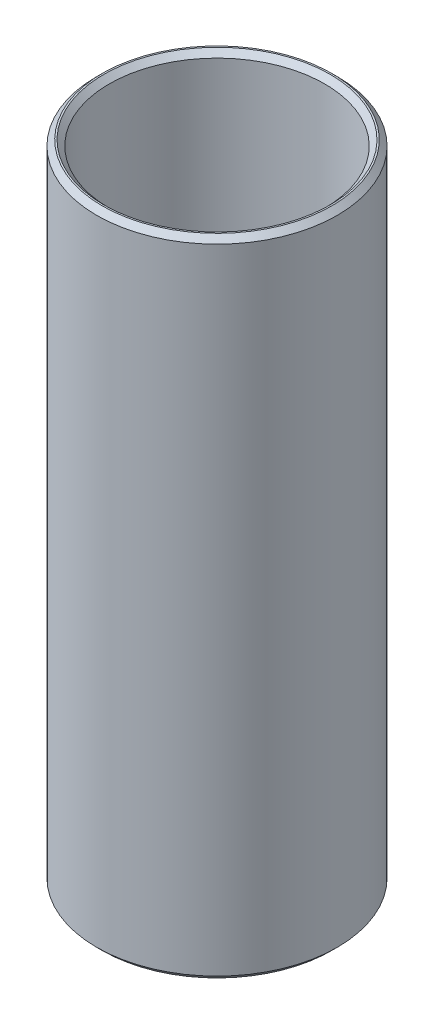
ISO-10303-21;
HEADER;
FILE_DESCRIPTION(('STEP AP214'),'2;1');
FILE_NAME('part.step','',(''),(''),'','','');
FILE_SCHEMA(('AUTOMOTIVE_DESIGN { 1 0 10303 214 1 1 1 1 }'));
ENDSEC;
DATA;
#1=APPLICATION_CONTEXT('core data for automotive mechanical design processes');
#2=APPLICATION_PROTOCOL_DEFINITION('international standard','automotive_design',2000,#1);
#3=PRODUCT_CONTEXT('',#1,'mechanical');
#4=PRODUCT('Part','Part','',(#3));
#5=PRODUCT_RELATED_PRODUCT_CATEGORY('part','',(#4));
#6=PRODUCT_DEFINITION_FORMATION('','',#4);
#7=PRODUCT_DEFINITION_CONTEXT('part definition',#1,'design');
#8=PRODUCT_DEFINITION('design','',#6,#7);
#9=PRODUCT_DEFINITION_SHAPE('','',#8);
#10=(LENGTH_UNIT() NAMED_UNIT(*) SI_UNIT(.MILLI.,.METRE.));
#11=(NAMED_UNIT(*) PLANE_ANGLE_UNIT() SI_UNIT($,.RADIAN.));
#12=(NAMED_UNIT(*) SI_UNIT($,.STERADIAN.) SOLID_ANGLE_UNIT());
#13=UNCERTAINTY_MEASURE_WITH_UNIT(LENGTH_MEASURE(1.E-05),#10,'distance_accuracy_value','');
#14=(GEOMETRIC_REPRESENTATION_CONTEXT(3) GLOBAL_UNCERTAINTY_ASSIGNED_CONTEXT((#13)) GLOBAL_UNIT_ASSIGNED_CONTEXT((#10,
#11,#12)) REPRESENTATION_CONTEXT('',''));
#15=CARTESIAN_POINT('',(0.,0.,0.));
#16=DIRECTION('',(0.,0.,1.));
#17=DIRECTION('',(1.,0.,0.));
#18=AXIS2_PLACEMENT_3D('',#15,#16,#17);
#19=CARTESIAN_POINT('',(0.,187.68618563041,0.));
#20=DIRECTION('',(0.,-1.,0.));
#21=DIRECTION('',(0.,0.,-1.));
#22=AXIS2_PLACEMENT_3D('',#19,#20,#21);
#23=CYLINDRICAL_SURFACE('',#22,35.);
#24=CARTESIAN_POINT('',(0.,1.59869676390303,0.));
#25=DIRECTION('',(0.,1.,0.));
#26=DIRECTION('',(0.,0.,1.));
#27=AXIS2_PLACEMENT_3D('',#24,#25,#26);
#28=CIRCLE('',#27,35.);
#29=CARTESIAN_POINT('',(0.,1.59869676390303,35.));
#30=VERTEX_POINT('',#29);
#31=EDGE_CURVE('E10',#30,#30,#28,.T.);
#32=ORIENTED_EDGE('',*,*,#31,.T.);
#33=EDGE_LOOP('',(#32));
#34=FACE_BOUND('',#33,.T.);
#35=CARTESIAN_POINT('',(0.,186.087488866507,0.));
#36=DIRECTION('',(0.,1.,0.));
#37=DIRECTION('',(0.,0.,1.));
#38=AXIS2_PLACEMENT_3D('',#35,#36,#37);
#39=CIRCLE('',#38,35.);
#40=CARTESIAN_POINT('',(0.,186.087488866507,35.));
#41=VERTEX_POINT('',#40);
#42=EDGE_CURVE('E50',#41,#41,#39,.F.);
#43=ORIENTED_EDGE('',*,*,#42,.T.);
#44=EDGE_LOOP('',(#43));
#45=FACE_BOUND('',#44,.T.);
#46=ADVANCED_FACE('F39',(#34,#45),#23,.T.);
#47=CARTESIAN_POINT('',(0.,187.68618563041,0.));
#48=DIRECTION('',(0.,1.,0.));
#49=DIRECTION('',(0.,0.,1.));
#50=AXIS2_PLACEMENT_3D('',#47,#48,#49);
#51=PLANE('',#50);
#52=CARTESIAN_POINT('',(0.,187.68618563041,0.));
#53=DIRECTION('',(0.,1.,0.));
#54=DIRECTION('',(0.,0.,1.));
#55=AXIS2_PLACEMENT_3D('',#52,#53,#54);
#56=CIRCLE('',#55,32.9330964865565);
#57=CARTESIAN_POINT('',(0.,187.68618563041,32.9330964865564));
#58=VERTEX_POINT('',#57);
#59=EDGE_CURVE('E58',#58,#58,#56,.F.);
#60=ORIENTED_EDGE('',*,*,#59,.T.);
#61=EDGE_LOOP('',(#60));
#62=FACE_BOUND('',#61,.T.);
#63=CARTESIAN_POINT('',(0.,187.68618563041,0.));
#64=DIRECTION('',(0.,1.,0.));
#65=DIRECTION('',(0.,0.,1.));
#66=AXIS2_PLACEMENT_3D('',#63,#64,#65);
#67=CIRCLE('',#66,33.4013032360969);
#68=CARTESIAN_POINT('',(0.,187.68618563041,33.4013032360969));
#69=VERTEX_POINT('',#68);
#70=EDGE_CURVE('E61',#69,#69,#67,.T.);
#71=ORIENTED_EDGE('',*,*,#70,.T.);
#72=EDGE_LOOP('',(#71));
#73=FACE_BOUND('',#72,.T.);
#74=ADVANCED_FACE('F88',(#62,#73),#51,.T.);
#75=CARTESIAN_POINT('',(0.,0.,0.));
#76=DIRECTION('',(0.,1.,0.));
#77=DIRECTION('',(0.,0.,1.));
#78=AXIS2_PLACEMENT_3D('',#75,#76,#77);
#79=PLANE('',#78);
#80=CARTESIAN_POINT('',(0.,0.,0.));
#81=DIRECTION('',(0.,1.,0.));
#82=DIRECTION('',(0.,0.,1.));
#83=AXIS2_PLACEMENT_3D('',#80,#81,#82);
#84=CIRCLE('',#83,32.9330964865566);
#85=CARTESIAN_POINT('',(0.,0.,32.9330964865566));
#86=VERTEX_POINT('',#85);
#87=EDGE_CURVE('E51',#86,#86,#84,.T.);
#88=ORIENTED_EDGE('',*,*,#87,.T.);
#89=EDGE_LOOP('',(#88));
#90=FACE_BOUND('',#89,.T.);
#91=CARTESIAN_POINT('',(0.,0.,0.));
#92=DIRECTION('',(0.,1.,0.));
#93=DIRECTION('',(0.,0.,1.));
#94=AXIS2_PLACEMENT_3D('',#91,#92,#93);
#95=CIRCLE('',#94,33.401303236097);
#96=CARTESIAN_POINT('',(0.,0.,33.401303236097));
#97=VERTEX_POINT('',#96);
#98=EDGE_CURVE('E54',#97,#97,#95,.F.);
#99=ORIENTED_EDGE('',*,*,#98,.T.);
#100=EDGE_LOOP('',(#99));
#101=FACE_BOUND('',#100,.T.);
#102=ADVANCED_FACE('F83',(#90,#101),#79,.F.);
#103=CARTESIAN_POINT('',(0.,187.68618563041,0.));
#104=DIRECTION('',(0.,-1.,0.));
#105=DIRECTION('',(0.,0.,-1.));
#106=AXIS2_PLACEMENT_3D('',#103,#104,#105);
#107=CYLINDRICAL_SURFACE('',#106,31.3343997226535);
#108=CARTESIAN_POINT('',(0.,186.087488866507,0.));
#109=DIRECTION('',(0.,1.,0.));
#110=DIRECTION('',(0.,0.,1.));
#111=AXIS2_PLACEMENT_3D('',#108,#109,#110);
#112=CIRCLE('',#111,31.3343997226535);
#113=CARTESIAN_POINT('',(0.,186.087488866507,31.3343997226535));
#114=VERTEX_POINT('',#113);
#115=EDGE_CURVE('E67',#114,#114,#112,.T.);
#116=ORIENTED_EDGE('',*,*,#115,.T.);
#117=EDGE_LOOP('',(#116));
#118=FACE_BOUND('',#117,.T.);
#119=CARTESIAN_POINT('',(0.,1.59869676390312,0.));
#120=DIRECTION('',(0.,1.,0.));
#121=DIRECTION('',(0.,0.,1.));
#122=AXIS2_PLACEMENT_3D('',#119,#120,#121);
#123=CIRCLE('',#122,31.3343997226535);
#124=CARTESIAN_POINT('',(0.,1.59869676390312,31.3343997226535));
#125=VERTEX_POINT('',#124);
#126=EDGE_CURVE('E69',#125,#125,#123,.F.);
#127=ORIENTED_EDGE('',*,*,#126,.T.);
#128=EDGE_LOOP('',(#127));
#129=FACE_BOUND('',#128,.T.);
#130=ADVANCED_FACE('F71',(#118,#129),#107,.F.);
#131=CARTESIAN_POINT('',(0.,186.087488866507,0.));
#132=DIRECTION('',(0.,1.,0.));
#133=DIRECTION('',(0.,0.,1.));
#134=AXIS2_PLACEMENT_3D('',#131,#132,#133);
#135=CONICAL_SURFACE('',#134,31.3343997226535,0.785398163397453);
#136=CARTESIAN_POINT('',(0.,187.68618563041,32.9330964865564));
#137=CARTESIAN_POINT('',(0.,187.669532539119,32.9164433952658));
#138=CARTESIAN_POINT('',(0.,187.652879447828,32.8997903039751));
#139=CARTESIAN_POINT('',(0.,187.619573265247,32.8664841213938));
#140=CARTESIAN_POINT('',(0.,187.602920173956,32.8498310301032));
#141=CARTESIAN_POINT('',(0.,187.569613991375,32.8165248475218));
#142=CARTESIAN_POINT('',(0.,187.552960900084,32.7998717562312));
#143=CARTESIAN_POINT('',(0.,187.519654717503,32.7665655736499));
#144=CARTESIAN_POINT('',(0.,187.503001626213,32.7499124823592));
#145=CARTESIAN_POINT('',(0.,187.469695443631,32.7166062997779));
#146=CARTESIAN_POINT('',(0.,187.453042352341,32.6999532084873));
#147=CARTESIAN_POINT('',(0.,187.419736169759,32.6666470259059));
#148=CARTESIAN_POINT('',(0.,187.403083078469,32.6499939346153));
#149=CARTESIAN_POINT('',(0.,187.369776895887,32.616687752034));
#150=CARTESIAN_POINT('',(0.,187.353123804597,32.6000346607433));
#151=CARTESIAN_POINT('',(0.,187.319817622015,32.566728478162));
#152=CARTESIAN_POINT('',(0.,187.303164530725,32.5500753868713));
#153=CARTESIAN_POINT('',(0.,187.269858348143,32.51676920429));
#154=CARTESIAN_POINT('',(0.,187.253205256853,32.5001161129994));
#155=CARTESIAN_POINT('',(0.,187.219899074271,32.4668099304181));
#156=CARTESIAN_POINT('',(0.,187.203245982981,32.4501568391274));
#157=CARTESIAN_POINT('',(0.,187.169939800399,32.4168506565461));
#158=CARTESIAN_POINT('',(0.,187.153286709109,32.4001975652554));
#159=CARTESIAN_POINT('',(0.,187.119980526527,32.3668913826741));
#160=CARTESIAN_POINT('',(0.,187.103327435237,32.3502382913835));
#161=CARTESIAN_POINT('',(0.,187.070021252655,32.3169321088022));
#162=CARTESIAN_POINT('',(0.,187.053368161365,32.3002790175115));
#163=CARTESIAN_POINT('',(0.,187.020061978784,32.2669728349302));
#164=CARTESIAN_POINT('',(0.,187.003408887493,32.2503197436395));
#165=CARTESIAN_POINT('',(0.,186.970102704912,32.2170135610582));
#166=CARTESIAN_POINT('',(0.,186.953449613621,32.2003604697676));
#167=CARTESIAN_POINT('',(0.,186.92014343104,32.1670542871863));
#168=CARTESIAN_POINT('',(0.,186.903490339749,32.1504011958956));
#169=CARTESIAN_POINT('',(0.,186.870184157168,32.1170950133143));
#170=CARTESIAN_POINT('',(0.,186.853531065877,32.1004419220236));
#171=CARTESIAN_POINT('',(0.,186.820224883296,32.0671357394423));
#172=CARTESIAN_POINT('',(0.,186.803571792005,32.0504826481517));
#173=CARTESIAN_POINT('',(0.,186.770265609424,32.0171764655704));
#174=CARTESIAN_POINT('',(0.,186.753612518133,32.0005233742797));
#175=CARTESIAN_POINT('',(0.,186.720306335552,31.9672171916984));
#176=CARTESIAN_POINT('',(0.,186.703653244261,31.9505641004077));
#177=CARTESIAN_POINT('',(0.,186.67034706168,31.9172579178264));
#178=CARTESIAN_POINT('',(0.,186.653693970389,31.9006048265358));
#179=CARTESIAN_POINT('',(0.,186.620387787808,31.8672986439544));
#180=CARTESIAN_POINT('',(0.,186.603734696517,31.8506455526638));
#181=CARTESIAN_POINT('',(0.,186.570428513936,31.8173393700825));
#182=CARTESIAN_POINT('',(0.,186.553775422645,31.8006862787918));
#183=CARTESIAN_POINT('',(0.,186.520469240064,31.7673800962105));
#184=CARTESIAN_POINT('',(0.,186.503816148773,31.7507270049199));
#185=CARTESIAN_POINT('',(0.,186.470509966192,31.7174208223385));
#186=CARTESIAN_POINT('',(0.,186.453856874901,31.7007677310479));
#187=CARTESIAN_POINT('',(0.,186.42055069232,31.6674615484666));
#188=CARTESIAN_POINT('',(0.,186.403897601029,31.6508084571759));
#189=CARTESIAN_POINT('',(0.,186.370591418448,31.6175022745946));
#190=CARTESIAN_POINT('',(0.,186.353938327157,31.6008491833039));
#191=CARTESIAN_POINT('',(0.,186.320632144576,31.5675430007226));
#192=CARTESIAN_POINT('',(0.,186.303979053285,31.550889909432));
#193=CARTESIAN_POINT('',(0.,186.270672870704,31.5175837268507));
#194=CARTESIAN_POINT('',(0.,186.254019779413,31.50093063556));
#195=CARTESIAN_POINT('',(0.,186.220713596832,31.4676244529787));
#196=CARTESIAN_POINT('',(0.,186.204060505541,31.450971361688));
#197=CARTESIAN_POINT('',(0.,186.17075432296,31.4176651791067));
#198=CARTESIAN_POINT('',(0.,186.154101231669,31.4010120878161));
#199=CARTESIAN_POINT('',(0.,186.120795049088,31.3677059052348));
#200=CARTESIAN_POINT('',(0.,186.104141957797,31.3510528139441));
#201=CARTESIAN_POINT('',(0.,186.087488866507,31.3343997226535));
#202=B_SPLINE_CURVE_WITH_KNOTS('',3,(#136,#137,#138,#139,#140,#141,#142,#143,#144,#145,#146,
#147,#148,#149,#150,#151,#152,#153,#154,#155,#156,#157,#158,#159,#160,#161,#162,#163,#164,#165,
#166,#167,#168,#169,#170,#171,#172,#173,#174,#175,#176,#177,#178,#179,#180,#181,#182,#183,#184,
#185,#186,#187,#188,#189,#190,#191,#192,#193,#194,#195,#196,#197,#198,#199,#200,#201),
.UNSPECIFIED.,.F.,.F.,(4,2,2,2,2,2,2,2,2,2,2,2,2,2,2,2,2,2,2,2,2,2,2,2,2,2,2,2,2,2,2,2,4),(0.,
0.0706530826760503,0.141306165352101,0.211959248028151,0.282612330704201,0.353265413380252,
0.423918496056302,0.494571578732352,0.565224661408398,0.635877744084448,0.706530826760498,
0.777183909436549,0.847836992112599,0.918490074788649,0.989143157464699,1.05979624014075,
1.1304493228168,1.20110240549285,1.2717554881689,1.34240857084495,1.413061653521,
1.48371473619705,1.5543678188731,1.62502090154915,1.6956739842252,1.76632706690125,
1.8369801495773,1.90763323225335,1.9782863149294,2.04893939760545,2.1195924802815,
2.19024556295755,2.26089864563358),.UNSPECIFIED.);
#203=EDGE_CURVE('BSEAM77',#58,#114,#202,.T.);
#204=ORIENTED_EDGE('',*,*,#59,.F.);
#205=ORIENTED_EDGE('',*,*,#115,.F.);
#206=ORIENTED_EDGE('',*,*,#203,.T.);
#207=ORIENTED_EDGE('',*,*,#203,.F.);
#208=EDGE_LOOP('',(#204,#206,#205,#207));
#209=FACE_BOUND('',#208,.T.);
#210=ADVANCED_FACE('F77',(#209),#135,.F.);
#211=CARTESIAN_POINT('',(0.,0.,0.));
#212=DIRECTION('',(0.,-1.,0.));
#213=DIRECTION('',(0.,0.,-1.));
#214=AXIS2_PLACEMENT_3D('',#211,#212,#213);
#215=CONICAL_SURFACE('',#214,32.9330964865566,0.78539816339744);
#216=ORIENTED_EDGE('',*,*,#126,.F.);
#217=EDGE_LOOP('',(#216));
#218=FACE_BOUND('',#217,.T.);
#219=ORIENTED_EDGE('',*,*,#87,.F.);
#220=EDGE_LOOP('',(#219));
#221=FACE_BOUND('',#220,.T.);
#222=ADVANCED_FACE('F73',(#218,#221),#215,.F.);
#223=CARTESIAN_POINT('',(0.,1.59869676390303,0.));
#224=DIRECTION('',(0.,1.,0.));
#225=DIRECTION('',(0.,0.,1.));
#226=AXIS2_PLACEMENT_3D('',#223,#224,#225);
#227=CONICAL_SURFACE('',#226,35.,0.785398163397446);
#228=CARTESIAN_POINT('',(0.,0.,33.401303236097));
#229=CARTESIAN_POINT('',(0.,0.0166530912906564,33.4179563273876));
#230=CARTESIAN_POINT('',(0.,0.033306182581313,33.4346094186783));
#231=CARTESIAN_POINT('',(0.,0.0666123651626262,33.4679156012596));
#232=CARTESIAN_POINT('',(0.,0.0832654564532828,33.4845686925503));
#233=CARTESIAN_POINT('',(0.,0.116571639034596,33.5178748751316));
#234=CARTESIAN_POINT('',(0.,0.133224730325253,33.5345279664222));
#235=CARTESIAN_POINT('',(0.,0.166530912906566,33.5678341490035));
#236=CARTESIAN_POINT('',(0.,0.183184004197222,33.5844872402942));
#237=CARTESIAN_POINT('',(0.,0.216490186778536,33.6177934228755));
#238=CARTESIAN_POINT('',(0.,0.233143278069193,33.6344465141662));
#239=CARTESIAN_POINT('',(0.,0.266449460650506,33.6677526967475));
#240=CARTESIAN_POINT('',(0.,0.283102551941162,33.6844057880381));
#241=CARTESIAN_POINT('',(0.,0.316408734522475,33.7177119706195));
#242=CARTESIAN_POINT('',(0.,0.333061825813132,33.7343650619101));
#243=CARTESIAN_POINT('',(0.,0.366368008394445,33.7676712444914));
#244=CARTESIAN_POINT('',(0.,0.383021099685102,33.7843243357821));
#245=CARTESIAN_POINT('',(0.,0.416327282266415,33.8176305183634));
#246=CARTESIAN_POINT('',(0.,0.432980373557072,33.8342836096541));
#247=CARTESIAN_POINT('',(0.,0.466286556138385,33.8675897922354));
#248=CARTESIAN_POINT('',(0.,0.482939647429041,33.884242883526));
#249=CARTESIAN_POINT('',(0.,0.516245830010355,33.9175490661073));
#250=CARTESIAN_POINT('',(0.,0.532898921301011,33.934202157398));
#251=CARTESIAN_POINT('',(0.,0.566205103882325,33.9675083399793));
#252=CARTESIAN_POINT('',(0.,0.582858195172981,33.98416143127));
#253=CARTESIAN_POINT('',(0.,0.616164377754295,34.0174676138513));
#254=CARTESIAN_POINT('',(0.,0.632817469044951,34.0341207051419));
#255=CARTESIAN_POINT('',(0.,0.666123651626264,34.0674268877232));
#256=CARTESIAN_POINT('',(0.,0.682776742916921,34.0840799790139));
#257=CARTESIAN_POINT('',(0.,0.716082925498234,34.1173861615952));
#258=CARTESIAN_POINT('',(0.,0.732736016788891,34.1340392528859));
#259=CARTESIAN_POINT('',(0.,0.766042199370204,34.1673454354672));
#260=CARTESIAN_POINT('',(0.,0.782695290660861,34.1839985267578));
#261=CARTESIAN_POINT('',(0.,0.816001473242174,34.2173047093392));
#262=CARTESIAN_POINT('',(0.,0.83265456453283,34.2339578006298));
#263=CARTESIAN_POINT('',(0.,0.865960747114143,34.2672639832111));
#264=CARTESIAN_POINT('',(0.,0.8826138384048,34.2839170745018));
#265=CARTESIAN_POINT('',(0.,0.915920020986114,34.3172232570831));
#266=CARTESIAN_POINT('',(0.,0.93257311227677,34.3338763483737));
#267=CARTESIAN_POINT('',(0.,0.965879294858083,34.3671825309551));
#268=CARTESIAN_POINT('',(0.,0.98253238614874,34.3838356222457));
#269=CARTESIAN_POINT('',(0.,1.01583856873005,34.417141804827));
#270=CARTESIAN_POINT('',(0.,1.03249166002071,34.4337948961177));
#271=CARTESIAN_POINT('',(0.,1.06579784260202,34.467101078699));
#272=CARTESIAN_POINT('',(0.,1.08245093389268,34.4837541699897));
#273=CARTESIAN_POINT('',(0.,1.11575711647399,34.517060352571));
#274=CARTESIAN_POINT('',(0.,1.13241020776465,34.5337134438616));
#275=CARTESIAN_POINT('',(0.,1.16571639034596,34.5670196264429));
#276=CARTESIAN_POINT('',(0.,1.18236948163662,34.5836727177336));
#277=CARTESIAN_POINT('',(0.,1.21567566421793,34.6169789003149));
#278=CARTESIAN_POINT('',(0.,1.23232875550859,34.6336319916056));
#279=CARTESIAN_POINT('',(0.,1.2656349380899,34.6669381741869));
#280=CARTESIAN_POINT('',(0.,1.28228802938056,34.6835912654775));
#281=CARTESIAN_POINT('',(0.,1.31559421196187,34.7168974480589));
#282=CARTESIAN_POINT('',(0.,1.33224730325253,34.7335505393495));
#283=CARTESIAN_POINT('',(0.,1.36555348583384,34.7668567219308));
#284=CARTESIAN_POINT('',(0.,1.3822065771245,34.7835098132215));
#285=CARTESIAN_POINT('',(0.,1.41551275970581,34.8168159958028));
#286=CARTESIAN_POINT('',(0.,1.43216585099647,34.8334690870934));
#287=CARTESIAN_POINT('',(0.,1.46547203357778,34.8667752696748));
#288=CARTESIAN_POINT('',(0.,1.48212512486844,34.8834283609654));
#289=CARTESIAN_POINT('',(0.,1.51543130744975,34.9167345435467));
#290=CARTESIAN_POINT('',(0.,1.53208439874041,34.9333876348374));
#291=CARTESIAN_POINT('',(0.,1.56539058132172,34.9666938174187));
#292=CARTESIAN_POINT('',(0.,1.58204367261238,34.9833469087094));
#293=CARTESIAN_POINT('',(0.,1.59869676390303,35.));
#294=B_SPLINE_CURVE_WITH_KNOTS('',3,(#228,#229,#230,#231,#232,#233,#234,#235,#236,#237,#238,
#239,#240,#241,#242,#243,#244,#245,#246,#247,#248,#249,#250,#251,#252,#253,#254,#255,#256,#257,
#258,#259,#260,#261,#262,#263,#264,#265,#266,#267,#268,#269,#270,#271,#272,#273,#274,#275,#276,
#277,#278,#279,#280,#281,#282,#283,#284,#285,#286,#287,#288,#289,#290,#291,#292,#293),
.UNSPECIFIED.,.F.,.F.,(4,2,2,2,2,2,2,2,2,2,2,2,2,2,2,2,2,2,2,2,2,2,2,2,2,2,2,2,2,2,2,2,4),(0.,
0.0706530826760509,0.141306165352102,0.211959248028153,0.282612330704204,0.353265413380255,
0.423918496056311,0.494571578732361,0.565224661408412,0.635877744084463,0.706530826760514,
0.777183909436565,0.847836992112616,0.918490074788667,0.989143157464718,1.05979624014077,
1.13044932281682,1.20110240549288,1.27175548816893,1.34240857084498,1.41306165352103,
1.48371473619708,1.55436781887313,1.62502090154918,1.69567398422523,1.76632706690128,
1.83698014957733,1.90763323225339,1.97828631492944,2.04893939760549,2.11959248028154,
2.19024556295759,2.26089864563364),.UNSPECIFIED.);
#295=EDGE_CURVE('BSEAM76',#97,#30,#294,.T.);
#296=ORIENTED_EDGE('',*,*,#98,.F.);
#297=ORIENTED_EDGE('',*,*,#31,.F.);
#298=ORIENTED_EDGE('',*,*,#295,.T.);
#299=ORIENTED_EDGE('',*,*,#295,.F.);
#300=EDGE_LOOP('',(#296,#298,#297,#299));
#301=FACE_BOUND('',#300,.T.);
#302=ADVANCED_FACE('F76',(#301),#227,.T.);
#303=CARTESIAN_POINT('',(0.,187.68618563041,0.));
#304=DIRECTION('',(0.,-1.,0.));
#305=DIRECTION('',(0.,0.,-1.));
#306=AXIS2_PLACEMENT_3D('',#303,#304,#305);
#307=CONICAL_SURFACE('',#306,33.4013032360969,0.78539816339745);
#308=ORIENTED_EDGE('',*,*,#42,.F.);
#309=EDGE_LOOP('',(#308));
#310=FACE_BOUND('',#309,.T.);
#311=ORIENTED_EDGE('',*,*,#70,.F.);
#312=EDGE_LOOP('',(#311));
#313=FACE_BOUND('',#312,.T.);
#314=ADVANCED_FACE('F45',(#310,#313),#307,.T.);
#315=CLOSED_SHELL('',(#46,#74,#102,#130,#210,#222,#302,#314));
#316=MANIFOLD_SOLID_BREP('B2',#315);
#317=ADVANCED_BREP_SHAPE_REPRESENTATION('',(#18,#316),#14);
#318=SHAPE_DEFINITION_REPRESENTATION(#9,#317);
ENDSEC;
END-ISO-10303-21;
